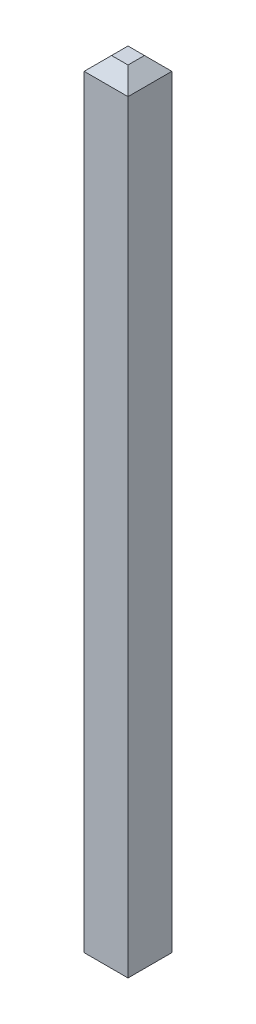
ISO-10303-21;
HEADER;
FILE_DESCRIPTION(('STEP AP214'),'2;1');
FILE_NAME('part.step','',(''),(''),'','','');
FILE_SCHEMA(('AUTOMOTIVE_DESIGN { 1 0 10303 214 1 1 1 1 }'));
ENDSEC;
DATA;
#1=APPLICATION_CONTEXT('core data for automotive mechanical design processes');
#2=APPLICATION_PROTOCOL_DEFINITION('international standard','automotive_design',2000,#1);
#3=PRODUCT_CONTEXT('',#1,'mechanical');
#4=PRODUCT('Part','Part','',(#3));
#5=PRODUCT_RELATED_PRODUCT_CATEGORY('part','',(#4));
#6=PRODUCT_DEFINITION_FORMATION('','',#4);
#7=PRODUCT_DEFINITION_CONTEXT('part definition',#1,'design');
#8=PRODUCT_DEFINITION('design','',#6,#7);
#9=PRODUCT_DEFINITION_SHAPE('','',#8);
#10=(LENGTH_UNIT() NAMED_UNIT(*) SI_UNIT(.MILLI.,.METRE.));
#11=(NAMED_UNIT(*) PLANE_ANGLE_UNIT() SI_UNIT($,.RADIAN.));
#12=(NAMED_UNIT(*) SI_UNIT($,.STERADIAN.) SOLID_ANGLE_UNIT());
#13=UNCERTAINTY_MEASURE_WITH_UNIT(LENGTH_MEASURE(1.E-05),#10,'distance_accuracy_value','');
#14=(GEOMETRIC_REPRESENTATION_CONTEXT(3) GLOBAL_UNCERTAINTY_ASSIGNED_CONTEXT((#13)) GLOBAL_UNIT_ASSIGNED_CONTEXT((#10,
#11,#12)) REPRESENTATION_CONTEXT('',''));
#15=CARTESIAN_POINT('',(0.,0.,0.));
#16=DIRECTION('',(0.,0.,1.));
#17=DIRECTION('',(1.,0.,0.));
#18=AXIS2_PLACEMENT_3D('',#15,#16,#17);
#19=CARTESIAN_POINT('',(-6.03,7.07,-0.32));
#20=DIRECTION('',(-0.707106781186548,-0.707106781186548,0.));
#21=DIRECTION('',(-0.707106781186548,0.707106781186548,0.));
#22=AXIS2_PLACEMENT_3D('',#19,#20,#21);
#23=PLANE('',#22);
#24=DIRECTION('',(0.577350269189626,-0.577350269189626,0.577350269189626));
#25=VECTOR('',#24,1.);
#26=CARTESIAN_POINT('',(-6.243333333333,7.283333333333,0.106666666667));
#27=LINE('',#26,#25);
#28=CARTESIAN_POINT('',(-6.23,7.27,0.12));
#29=VERTEX_POINT('',#28);
#30=CARTESIAN_POINT('',(-6.03,7.07,0.32));
#31=VERTEX_POINT('',#30);
#32=EDGE_CURVE('E110',#29,#31,#27,.T.);
#33=ORIENTED_EDGE('',*,*,#32,.T.);
#34=DIRECTION('',(0.,0.,1.));
#35=VECTOR('',#34,1.);
#36=CARTESIAN_POINT('',(-6.03,7.07,-0.32));
#37=LINE('',#36,#35);
#38=CARTESIAN_POINT('',(-6.03,7.07,-0.32));
#39=VERTEX_POINT('',#38);
#40=EDGE_CURVE('E106',#39,#31,#37,.T.);
#41=ORIENTED_EDGE('',*,*,#40,.F.);
#42=DIRECTION('',(0.577350269189626,-0.577350269189626,-0.577350269189626));
#43=VECTOR('',#42,1.);
#44=CARTESIAN_POINT('',(-6.03,7.07,-0.32));
#45=LINE('',#44,#43);
#46=CARTESIAN_POINT('',(-6.23,7.27,-0.12));
#47=VERTEX_POINT('',#46);
#48=EDGE_CURVE('E11',#47,#39,#45,.T.);
#49=ORIENTED_EDGE('',*,*,#48,.F.);
#50=DIRECTION('',(0.,0.,-1.));
#51=VECTOR('',#50,1.);
#52=CARTESIAN_POINT('',(-6.23,7.27,-0.32));
#53=LINE('',#52,#51);
#54=EDGE_CURVE('E115',#29,#47,#53,.T.);
#55=ORIENTED_EDGE('',*,*,#54,.F.);
#56=EDGE_LOOP('',(#33,#41,#49,#55));
#57=FACE_BOUND('',#56,.T.);
#58=ADVANCED_FACE('F16',(#57),#23,.F.);
#59=CARTESIAN_POINT('',(-6.35,7.07,-0.32));
#60=DIRECTION('',(0.,0.707106781186548,-0.707106781186548));
#61=DIRECTION('',(-1.,0.,0.));
#62=AXIS2_PLACEMENT_3D('',#59,#60,#61);
#63=PLANE('',#62);
#64=DIRECTION('',(0.577350269189626,0.577350269189626,0.577350269189626));
#65=VECTOR('',#64,1.);
#66=CARTESIAN_POINT('',(-6.536666666667,7.203333333333,-0.186666666667));
#67=LINE('',#66,#65);
#68=CARTESIAN_POINT('',(-6.67,7.07,-0.32));
#69=VERTEX_POINT('',#68);
#70=CARTESIAN_POINT('',(-6.47,7.27,-0.12));
#71=VERTEX_POINT('',#70);
#72=EDGE_CURVE('E27',#69,#71,#67,.T.);
#73=ORIENTED_EDGE('',*,*,#72,.T.);
#74=DIRECTION('',(-1.,0.,0.));
#75=VECTOR('',#74,1.);
#76=CARTESIAN_POINT('',(-6.67,7.27,-0.12));
#77=LINE('',#76,#75);
#78=EDGE_CURVE('E100',#47,#71,#77,.T.);
#79=ORIENTED_EDGE('',*,*,#78,.F.);
#80=ORIENTED_EDGE('',*,*,#48,.T.);
#81=DIRECTION('',(1.,0.,0.));
#82=VECTOR('',#81,1.);
#83=CARTESIAN_POINT('',(-6.03,7.07,-0.32));
#84=LINE('',#83,#82);
#85=EDGE_CURVE('E97',#69,#39,#84,.T.);
#86=ORIENTED_EDGE('',*,*,#85,.F.);
#87=EDGE_LOOP('',(#73,#79,#80,#86));
#88=FACE_BOUND('',#87,.T.);
#89=ADVANCED_FACE('F95',(#88),#63,.T.);
#90=CARTESIAN_POINT('',(-6.47,7.27,-0.32));
#91=DIRECTION('',(0.707106781186548,-0.707106781186548,0.));
#92=DIRECTION('',(0.,0.,-1.));
#93=AXIS2_PLACEMENT_3D('',#90,#91,#92);
#94=PLANE('',#93);
#95=DIRECTION('',(-0.577350269189626,-0.577350269189626,0.577350269189626));
#96=VECTOR('',#95,1.);
#97=CARTESIAN_POINT('',(-6.536666666667,7.203333333333,0.186666666667));
#98=LINE('',#97,#96);
#99=CARTESIAN_POINT('',(-6.47,7.27,0.12));
#100=VERTEX_POINT('',#99);
#101=CARTESIAN_POINT('',(-6.67,7.07,0.32));
#102=VERTEX_POINT('',#101);
#103=EDGE_CURVE('E41',#100,#102,#98,.T.);
#104=ORIENTED_EDGE('',*,*,#103,.F.);
#105=DIRECTION('',(0.,0.,1.));
#106=VECTOR('',#105,1.);
#107=CARTESIAN_POINT('',(-6.47,7.27,-0.32));
#108=LINE('',#107,#106);
#109=EDGE_CURVE('E155',#71,#100,#108,.T.);
#110=ORIENTED_EDGE('',*,*,#109,.F.);
#111=ORIENTED_EDGE('',*,*,#72,.F.);
#112=DIRECTION('',(0.,0.,-1.));
#113=VECTOR('',#112,1.);
#114=CARTESIAN_POINT('',(-6.67,7.07,-0.32));
#115=LINE('',#114,#113);
#116=EDGE_CURVE('E163',#102,#69,#115,.T.);
#117=ORIENTED_EDGE('',*,*,#116,.F.);
#118=EDGE_LOOP('',(#104,#110,#111,#117));
#119=FACE_BOUND('',#118,.T.);
#120=ADVANCED_FACE('F216',(#119),#94,.F.);
#121=CARTESIAN_POINT('',(-6.67,7.27,0.12));
#122=DIRECTION('',(0.,-0.707106781186548,-0.707106781186548));
#123=DIRECTION('',(0.,-0.707106781186548,0.707106781186548));
#124=AXIS2_PLACEMENT_3D('',#121,#122,#123);
#125=PLANE('',#124);
#126=ORIENTED_EDGE('',*,*,#32,.F.);
#127=DIRECTION('',(1.,0.,0.));
#128=VECTOR('',#127,1.);
#129=CARTESIAN_POINT('',(-6.67,7.27,0.12));
#130=LINE('',#129,#128);
#131=EDGE_CURVE('E151',#100,#29,#130,.T.);
#132=ORIENTED_EDGE('',*,*,#131,.F.);
#133=ORIENTED_EDGE('',*,*,#103,.T.);
#134=DIRECTION('',(-1.,0.,0.));
#135=VECTOR('',#134,1.);
#136=CARTESIAN_POINT('',(-6.35,7.07,0.32));
#137=LINE('',#136,#135);
#138=EDGE_CURVE('E116',#31,#102,#137,.T.);
#139=ORIENTED_EDGE('',*,*,#138,.F.);
#140=EDGE_LOOP('',(#126,#132,#133,#139));
#141=FACE_BOUND('',#140,.T.);
#142=ADVANCED_FACE('F251',(#141),#125,.F.);
#143=CARTESIAN_POINT('',(-6.67,7.27,-0.32));
#144=DIRECTION('',(0.,-1.,0.));
#145=DIRECTION('',(0.,0.,-1.));
#146=AXIS2_PLACEMENT_3D('',#143,#144,#145);
#147=PLANE('',#146);
#148=ORIENTED_EDGE('',*,*,#54,.T.);
#149=ORIENTED_EDGE('',*,*,#78,.T.);
#150=ORIENTED_EDGE('',*,*,#109,.T.);
#151=ORIENTED_EDGE('',*,*,#131,.T.);
#152=EDGE_LOOP('',(#148,#149,#150,#151));
#153=FACE_BOUND('',#152,.T.);
#154=ADVANCED_FACE('F218',(#153),#147,.F.);
#155=CARTESIAN_POINT('',(-6.03,7.27,-0.32));
#156=DIRECTION('',(-1.,0.,0.));
#157=DIRECTION('',(0.,1.,0.));
#158=AXIS2_PLACEMENT_3D('',#155,#156,#157);
#159=PLANE('',#158);
#160=DIRECTION('',(0.,-1.,0.));
#161=VECTOR('',#160,1.);
#162=CARTESIAN_POINT('',(-6.03,7.27,-0.32));
#163=LINE('',#162,#161);
#164=CARTESIAN_POINT('',(-6.03,-4.07,-0.32));
#165=VERTEX_POINT('',#164);
#166=EDGE_CURVE('E119',#39,#165,#163,.T.);
#167=ORIENTED_EDGE('',*,*,#166,.F.);
#168=ORIENTED_EDGE('',*,*,#40,.T.);
#169=DIRECTION('',(0.,-1.,0.));
#170=VECTOR('',#169,1.);
#171=CARTESIAN_POINT('',(-6.03,7.27,0.32));
#172=LINE('',#171,#170);
#173=CARTESIAN_POINT('',(-6.03,-4.07,0.32));
#174=VERTEX_POINT('',#173);
#175=EDGE_CURVE('E171',#31,#174,#172,.T.);
#176=ORIENTED_EDGE('',*,*,#175,.T.);
#177=DIRECTION('',(0.,0.,-1.));
#178=VECTOR('',#177,1.);
#179=CARTESIAN_POINT('',(-6.03,-4.07,-0.32));
#180=LINE('',#179,#178);
#181=EDGE_CURVE('E122',#174,#165,#180,.T.);
#182=ORIENTED_EDGE('',*,*,#181,.T.);
#183=EDGE_LOOP('',(#167,#168,#176,#182));
#184=FACE_BOUND('',#183,.T.);
#185=ADVANCED_FACE('F120',(#184),#159,.F.);
#186=CARTESIAN_POINT('',(-6.35,1.5,0.32));
#187=DIRECTION('',(0.,0.,-1.));
#188=DIRECTION('',(0.,-1.,0.));
#189=AXIS2_PLACEMENT_3D('',#186,#187,#188);
#190=PLANE('',#189);
#191=ORIENTED_EDGE('',*,*,#175,.F.);
#192=ORIENTED_EDGE('',*,*,#138,.T.);
#193=DIRECTION('',(0.,1.,0.));
#194=VECTOR('',#193,1.);
#195=CARTESIAN_POINT('',(-6.67,-4.27,0.32));
#196=LINE('',#195,#194);
#197=CARTESIAN_POINT('',(-6.67,-4.07,0.32));
#198=VERTEX_POINT('',#197);
#199=EDGE_CURVE('E127',#198,#102,#196,.T.);
#200=ORIENTED_EDGE('',*,*,#199,.F.);
#201=DIRECTION('',(1.,0.,0.));
#202=VECTOR('',#201,1.);
#203=CARTESIAN_POINT('',(-6.35,-4.07,0.32));
#204=LINE('',#203,#202);
#205=EDGE_CURVE('E20',#198,#174,#204,.T.);
#206=ORIENTED_EDGE('',*,*,#205,.T.);
#207=EDGE_LOOP('',(#191,#192,#200,#206));
#208=FACE_BOUND('',#207,.T.);
#209=ADVANCED_FACE('F213',(#208),#190,.F.);
#210=CARTESIAN_POINT('',(-6.23,-4.27,-0.32));
#211=DIRECTION('',(-0.707106781186548,0.707106781186548,0.));
#212=DIRECTION('',(0.,0.,1.));
#213=AXIS2_PLACEMENT_3D('',#210,#211,#212);
#214=PLANE('',#213);
#215=DIRECTION('',(-0.577350269189626,-0.577350269189626,0.577350269189626));
#216=VECTOR('',#215,1.);
#217=CARTESIAN_POINT('',(-6.163333333333,-4.203333333333,-0.186666666667));
#218=LINE('',#217,#216);
#219=CARTESIAN_POINT('',(-6.23,-4.27,-0.12));
#220=VERTEX_POINT('',#219);
#221=EDGE_CURVE('E138',#165,#220,#218,.T.);
#222=ORIENTED_EDGE('',*,*,#221,.F.);
#223=ORIENTED_EDGE('',*,*,#181,.F.);
#224=DIRECTION('',(-0.577350269189626,-0.577350269189626,-0.577350269189626));
#225=VECTOR('',#224,1.);
#226=CARTESIAN_POINT('',(-6.376666666667,-4.416666666667,-0.02666666666667));
#227=LINE('',#226,#225);
#228=CARTESIAN_POINT('',(-6.23,-4.27,0.12));
#229=VERTEX_POINT('',#228);
#230=EDGE_CURVE('E143',#174,#229,#227,.T.);
#231=ORIENTED_EDGE('',*,*,#230,.T.);
#232=DIRECTION('',(0.,0.,1.));
#233=VECTOR('',#232,1.);
#234=CARTESIAN_POINT('',(-6.23,-4.27,-0.32));
#235=LINE('',#234,#233);
#236=EDGE_CURVE('E146',#220,#229,#235,.T.);
#237=ORIENTED_EDGE('',*,*,#236,.F.);
#238=EDGE_LOOP('',(#222,#223,#231,#237));
#239=FACE_BOUND('',#238,.T.);
#240=ADVANCED_FACE('F256',(#239),#214,.F.);
#241=CARTESIAN_POINT('',(-6.03,-4.27,0.12));
#242=DIRECTION('',(0.,0.707106781186548,-0.707106781186548));
#243=DIRECTION('',(-1.,0.,0.));
#244=AXIS2_PLACEMENT_3D('',#241,#242,#243);
#245=PLANE('',#244);
#246=ORIENTED_EDGE('',*,*,#230,.F.);
#247=ORIENTED_EDGE('',*,*,#205,.F.);
#248=DIRECTION('',(-0.577350269189626,0.577350269189626,0.577350269189626));
#249=VECTOR('',#248,1.);
#250=CARTESIAN_POINT('',(-6.456666666667,-4.283333333333,0.106666666667));
#251=LINE('',#250,#249);
#252=CARTESIAN_POINT('',(-6.47,-4.27,0.12));
#253=VERTEX_POINT('',#252);
#254=EDGE_CURVE('E145',#253,#198,#251,.T.);
#255=ORIENTED_EDGE('',*,*,#254,.F.);
#256=DIRECTION('',(-1.,0.,0.));
#257=VECTOR('',#256,1.);
#258=CARTESIAN_POINT('',(-6.03,-4.27,0.12));
#259=LINE('',#258,#257);
#260=EDGE_CURVE('E149',#229,#253,#259,.T.);
#261=ORIENTED_EDGE('',*,*,#260,.F.);
#262=EDGE_LOOP('',(#246,#247,#255,#261));
#263=FACE_BOUND('',#262,.T.);
#264=ADVANCED_FACE('F260',(#263),#245,.F.);
#265=CARTESIAN_POINT('',(-6.67,-4.07,-0.32));
#266=DIRECTION('',(0.707106781186548,0.707106781186548,0.));
#267=DIRECTION('',(0.,0.,-1.));
#268=AXIS2_PLACEMENT_3D('',#265,#266,#267);
#269=PLANE('',#268);
#270=DIRECTION('',(0.577350269189626,-0.577350269189626,0.577350269189626));
#271=VECTOR('',#270,1.);
#272=CARTESIAN_POINT('',(-6.563333333333,-4.176666666667,-0.213333333333));
#273=LINE('',#272,#271);
#274=CARTESIAN_POINT('',(-6.67,-4.07,-0.32));
#275=VERTEX_POINT('',#274);
#276=CARTESIAN_POINT('',(-6.47,-4.27,-0.12));
#277=VERTEX_POINT('',#276);
#278=EDGE_CURVE('E159',#275,#277,#273,.T.);
#279=ORIENTED_EDGE('',*,*,#278,.T.);
#280=DIRECTION('',(0.,0.,-1.));
#281=VECTOR('',#280,1.);
#282=CARTESIAN_POINT('',(-6.47,-4.27,-0.32));
#283=LINE('',#282,#281);
#284=EDGE_CURVE('E178',#253,#277,#283,.T.);
#285=ORIENTED_EDGE('',*,*,#284,.F.);
#286=ORIENTED_EDGE('',*,*,#254,.T.);
#287=DIRECTION('',(0.,0.,1.));
#288=VECTOR('',#287,1.);
#289=CARTESIAN_POINT('',(-6.67,-4.07,-0.32));
#290=LINE('',#289,#288);
#291=EDGE_CURVE('E181',#275,#198,#290,.T.);
#292=ORIENTED_EDGE('',*,*,#291,.F.);
#293=EDGE_LOOP('',(#279,#285,#286,#292));
#294=FACE_BOUND('',#293,.T.);
#295=ADVANCED_FACE('F203',(#294),#269,.F.);
#296=CARTESIAN_POINT('',(-6.67,-4.27,-0.32));
#297=DIRECTION('',(1.,0.,0.));
#298=DIRECTION('',(0.,0.,1.));
#299=AXIS2_PLACEMENT_3D('',#296,#297,#298);
#300=PLANE('',#299);
#301=ORIENTED_EDGE('',*,*,#199,.T.);
#302=ORIENTED_EDGE('',*,*,#116,.T.);
#303=DIRECTION('',(0.,1.,0.));
#304=VECTOR('',#303,1.);
#305=CARTESIAN_POINT('',(-6.67,-4.27,-0.32));
#306=LINE('',#305,#304);
#307=EDGE_CURVE('E131',#275,#69,#306,.T.);
#308=ORIENTED_EDGE('',*,*,#307,.F.);
#309=ORIENTED_EDGE('',*,*,#291,.T.);
#310=EDGE_LOOP('',(#301,#302,#308,#309));
#311=FACE_BOUND('',#310,.T.);
#312=ADVANCED_FACE('F209',(#311),#300,.F.);
#313=CARTESIAN_POINT('',(-6.35,1.5,-0.32));
#314=DIRECTION('',(0.,0.,-1.));
#315=DIRECTION('',(0.,-1.,0.));
#316=AXIS2_PLACEMENT_3D('',#313,#314,#315);
#317=PLANE('',#316);
#318=ORIENTED_EDGE('',*,*,#307,.T.);
#319=ORIENTED_EDGE('',*,*,#85,.T.);
#320=ORIENTED_EDGE('',*,*,#166,.T.);
#321=DIRECTION('',(-1.,0.,0.));
#322=VECTOR('',#321,1.);
#323=CARTESIAN_POINT('',(-6.67,-4.07,-0.32));
#324=LINE('',#323,#322);
#325=EDGE_CURVE('E156',#165,#275,#324,.T.);
#326=ORIENTED_EDGE('',*,*,#325,.T.);
#327=EDGE_LOOP('',(#318,#319,#320,#326));
#328=FACE_BOUND('',#327,.T.);
#329=ADVANCED_FACE('F129',(#328),#317,.T.);
#330=CARTESIAN_POINT('',(-6.35,-4.07,-0.32));
#331=DIRECTION('',(0.,-0.707106781186548,-0.707106781186548));
#332=DIRECTION('',(0.,-0.707106781186548,0.707106781186548));
#333=AXIS2_PLACEMENT_3D('',#330,#331,#332);
#334=PLANE('',#333);
#335=ORIENTED_EDGE('',*,*,#278,.F.);
#336=ORIENTED_EDGE('',*,*,#325,.F.);
#337=ORIENTED_EDGE('',*,*,#221,.T.);
#338=DIRECTION('',(1.,0.,0.));
#339=VECTOR('',#338,1.);
#340=CARTESIAN_POINT('',(-6.03,-4.27,-0.12));
#341=LINE('',#340,#339);
#342=EDGE_CURVE('E174',#277,#220,#341,.T.);
#343=ORIENTED_EDGE('',*,*,#342,.F.);
#344=EDGE_LOOP('',(#335,#336,#337,#343));
#345=FACE_BOUND('',#344,.T.);
#346=ADVANCED_FACE('F18',(#345),#334,.T.);
#347=CARTESIAN_POINT('',(-6.03,-4.27,-0.32));
#348=DIRECTION('',(0.,1.,0.));
#349=DIRECTION('',(0.,0.,-1.));
#350=AXIS2_PLACEMENT_3D('',#347,#348,#349);
#351=PLANE('',#350);
#352=ORIENTED_EDGE('',*,*,#236,.T.);
#353=ORIENTED_EDGE('',*,*,#260,.T.);
#354=ORIENTED_EDGE('',*,*,#284,.T.);
#355=ORIENTED_EDGE('',*,*,#342,.T.);
#356=EDGE_LOOP('',(#352,#353,#354,#355));
#357=FACE_BOUND('',#356,.T.);
#358=ADVANCED_FACE('F230',(#357),#351,.F.);
#359=CLOSED_SHELL('',(#58,#89,#120,#142,#154,#185,#209,#240,#264,#295,#312,#329,#346,#358));
#360=MANIFOLD_SOLID_BREP('B1',#359);
#361=ADVANCED_BREP_SHAPE_REPRESENTATION('',(#18,#360),#14);
#362=SHAPE_DEFINITION_REPRESENTATION(#9,#361);
ENDSEC;
END-ISO-10303-21;
